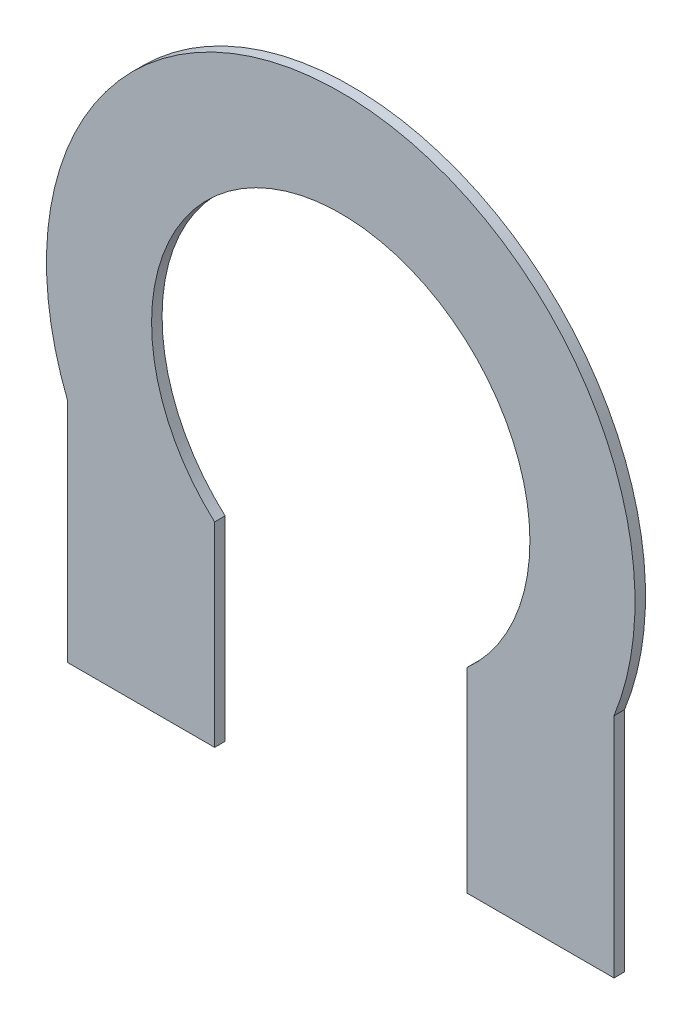
ISO-10303-21;
HEADER;
FILE_DESCRIPTION(('STEP AP214'),'2;1');
FILE_NAME('part.step','',(''),(''),'','','');
FILE_SCHEMA(('AUTOMOTIVE_DESIGN { 1 0 10303 214 1 1 1 1 }'));
ENDSEC;
DATA;
#1=APPLICATION_CONTEXT('core data for automotive mechanical design processes');
#2=APPLICATION_PROTOCOL_DEFINITION('international standard','automotive_design',2000,#1);
#3=PRODUCT_CONTEXT('',#1,'mechanical');
#4=PRODUCT('Part','Part','',(#3));
#5=PRODUCT_RELATED_PRODUCT_CATEGORY('part','',(#4));
#6=PRODUCT_DEFINITION_FORMATION('','',#4);
#7=PRODUCT_DEFINITION_CONTEXT('part definition',#1,'design');
#8=PRODUCT_DEFINITION('design','',#6,#7);
#9=PRODUCT_DEFINITION_SHAPE('','',#8);
#10=(LENGTH_UNIT() NAMED_UNIT(*) SI_UNIT(.MILLI.,.METRE.));
#11=(NAMED_UNIT(*) PLANE_ANGLE_UNIT() SI_UNIT($,.RADIAN.));
#12=(NAMED_UNIT(*) SI_UNIT($,.STERADIAN.) SOLID_ANGLE_UNIT());
#13=UNCERTAINTY_MEASURE_WITH_UNIT(LENGTH_MEASURE(1.E-05),#10,'distance_accuracy_value','');
#14=(GEOMETRIC_REPRESENTATION_CONTEXT(3) GLOBAL_UNCERTAINTY_ASSIGNED_CONTEXT((#13)) GLOBAL_UNIT_ASSIGNED_CONTEXT((#10,
#11,#12)) REPRESENTATION_CONTEXT('',''));
#15=CARTESIAN_POINT('',(0.,0.,0.));
#16=DIRECTION('',(0.,0.,1.));
#17=DIRECTION('',(1.,0.,0.));
#18=AXIS2_PLACEMENT_3D('',#15,#16,#17);
#19=CARTESIAN_POINT('',(1.6963001622179,-2.601,-7.7));
#20=DIRECTION('',(0.,0.,-1.));
#21=DIRECTION('',(-1.,0.,0.));
#22=AXIS2_PLACEMENT_3D('',#19,#20,#21);
#23=PLANE('',#22);
#24=DIRECTION('',(1.,0.,0.));
#25=VECTOR('',#24,1.);
#26=CARTESIAN_POINT('',(0.95,-2.6,-7.7));
#27=LINE('',#26,#25);
#28=CARTESIAN_POINT('',(0.6,-2.6,-7.7));
#29=VERTEX_POINT('',#28);
#30=CARTESIAN_POINT('',(1.3,-2.6,-7.7));
#31=VERTEX_POINT('',#30);
#32=EDGE_CURVE('E141',#29,#31,#27,.T.);
#33=ORIENTED_EDGE('',*,*,#32,.F.);
#34=DIRECTION('',(0.,-1.,0.));
#35=VECTOR('',#34,1.);
#36=CARTESIAN_POINT('',(0.6,-2.135410196625,-7.7));
#37=LINE('',#36,#35);
#38=CARTESIAN_POINT('',(0.6,-1.6708203932498,-7.7));
#39=VERTEX_POINT('',#38);
#40=EDGE_CURVE('E92',#39,#29,#37,.T.);
#41=ORIENTED_EDGE('',*,*,#40,.F.);
#42=CARTESIAN_POINT('',(-1.84140224667253E-13,-1.00000000000004,-7.7));
#43=DIRECTION('',(0.,0.,-1.));
#44=DIRECTION('',(-1.,0.,0.));
#45=AXIS2_PLACEMENT_3D('',#42,#43,#44);
#46=CIRCLE('',#45,0.899999999999845);
#47=CARTESIAN_POINT('',(-0.6,-1.67082039324997,-7.7));
#48=VERTEX_POINT('',#47);
#49=EDGE_CURVE('E21',#48,#39,#46,.T.);
#50=ORIENTED_EDGE('',*,*,#49,.F.);
#51=DIRECTION('',(0.,-1.,0.));
#52=VECTOR('',#51,1.);
#53=CARTESIAN_POINT('',(-0.6,-0.920462059558933,-7.7));
#54=LINE('',#53,#52);
#55=CARTESIAN_POINT('',(-0.6,-2.6,-7.7));
#56=VERTEX_POINT('',#55);
#57=EDGE_CURVE('E80',#48,#56,#54,.T.);
#58=ORIENTED_EDGE('',*,*,#57,.T.);
#59=DIRECTION('',(-1.,0.,0.));
#60=VECTOR('',#59,1.);
#61=CARTESIAN_POINT('',(0.,-2.6,-7.7));
#62=LINE('',#61,#60);
#63=CARTESIAN_POINT('',(-1.3,-2.6,-7.7));
#64=VERTEX_POINT('',#63);
#65=EDGE_CURVE('E87',#56,#64,#62,.T.);
#66=ORIENTED_EDGE('',*,*,#65,.T.);
#67=DIRECTION('',(0.,1.,0.));
#68=VECTOR('',#67,1.);
#69=CARTESIAN_POINT('',(-1.3,-0.920462059558933,-7.7));
#70=LINE('',#69,#68);
#71=CARTESIAN_POINT('',(-1.3,-1.51961524227034,-7.7));
#72=VERTEX_POINT('',#71);
#73=EDGE_CURVE('E96',#64,#72,#70,.T.);
#74=ORIENTED_EDGE('',*,*,#73,.T.);
#75=CARTESIAN_POINT('',(6.29541991453708E-13,-1.00000000000018,-7.7));
#76=DIRECTION('',(0.,0.,1.));
#77=DIRECTION('',(1.,0.,0.));
#78=AXIS2_PLACEMENT_3D('',#75,#76,#77);
#79=CIRCLE('',#78,1.40000000000052);
#80=CARTESIAN_POINT('',(1.30000000000012,-1.51961524227196,-7.7));
#81=VERTEX_POINT('',#80);
#82=EDGE_CURVE('E121',#81,#72,#79,.T.);
#83=ORIENTED_EDGE('',*,*,#82,.F.);
#84=DIRECTION('',(0.,1.,0.));
#85=VECTOR('',#84,1.);
#86=CARTESIAN_POINT('',(1.3,-2.059807621135,-7.7));
#87=LINE('',#86,#85);
#88=EDGE_CURVE('E125',#31,#81,#87,.T.);
#89=ORIENTED_EDGE('',*,*,#88,.F.);
#90=EDGE_LOOP('',(#33,#41,#50,#58,#66,#74,#83,#89));
#91=FACE_BOUND('',#90,.T.);
#92=ADVANCED_FACE('F17',(#91),#23,.T.);
#93=CARTESIAN_POINT('',(-1.84260159213911E-13,-1.00000000000004,-7.65));
#94=DIRECTION('',(0.,0.,-1.));
#95=DIRECTION('',(-1.,0.,0.));
#96=AXIS2_PLACEMENT_3D('',#93,#94,#95);
#97=CYLINDRICAL_SURFACE('',#96,0.899999999999845);
#98=CARTESIAN_POINT('',(-1.84260159213911E-13,-1.00000000000004,-7.65));
#99=DIRECTION('',(0.,0.,-1.));
#100=DIRECTION('',(-1.,0.,0.));
#101=AXIS2_PLACEMENT_3D('',#98,#99,#100);
#102=CIRCLE('',#101,0.899999999999845);
#103=CARTESIAN_POINT('',(-0.6,-1.67082039324997,-7.65));
#104=VERTEX_POINT('',#103);
#105=CARTESIAN_POINT('',(0.6,-1.6708203932498,-7.65));
#106=VERTEX_POINT('',#105);
#107=EDGE_CURVE('E99',#104,#106,#102,.T.);
#108=ORIENTED_EDGE('',*,*,#107,.F.);
#109=DIRECTION('',(0.,0.,1.));
#110=VECTOR('',#109,1.);
#111=CARTESIAN_POINT('',(-0.6,-1.67082039325,-7.675));
#112=LINE('',#111,#110);
#113=EDGE_CURVE('E84',#48,#104,#112,.T.);
#114=ORIENTED_EDGE('',*,*,#113,.F.);
#115=ORIENTED_EDGE('',*,*,#49,.T.);
#116=DIRECTION('',(0.,0.,-1.));
#117=VECTOR('',#116,1.);
#118=CARTESIAN_POINT('',(0.6,-1.67082039325,-7.675));
#119=LINE('',#118,#117);
#120=EDGE_CURVE('E95',#106,#39,#119,.T.);
#121=ORIENTED_EDGE('',*,*,#120,.F.);
#122=EDGE_LOOP('',(#108,#114,#115,#121));
#123=FACE_BOUND('',#122,.T.);
#124=ADVANCED_FACE('F97',(#123),#97,.F.);
#125=CARTESIAN_POINT('',(0.6,-2.601,-7.649));
#126=DIRECTION('',(-1.,0.,0.));
#127=DIRECTION('',(0.,1.,0.));
#128=AXIS2_PLACEMENT_3D('',#125,#126,#127);
#129=PLANE('',#128);
#130=ORIENTED_EDGE('',*,*,#120,.T.);
#131=ORIENTED_EDGE('',*,*,#40,.T.);
#132=DIRECTION('',(0.,0.,-1.));
#133=VECTOR('',#132,1.);
#134=CARTESIAN_POINT('',(0.6,-2.6,-7.675));
#135=LINE('',#134,#133);
#136=CARTESIAN_POINT('',(0.6,-2.6,-7.65));
#137=VERTEX_POINT('',#136);
#138=EDGE_CURVE('E129',#137,#29,#135,.T.);
#139=ORIENTED_EDGE('',*,*,#138,.F.);
#140=DIRECTION('',(0.,-1.,0.));
#141=VECTOR('',#140,1.);
#142=CARTESIAN_POINT('',(0.6,-0.920462059558933,-7.65));
#143=LINE('',#142,#141);
#144=EDGE_CURVE('E136',#106,#137,#143,.T.);
#145=ORIENTED_EDGE('',*,*,#144,.F.);
#146=EDGE_LOOP('',(#130,#131,#139,#145));
#147=FACE_BOUND('',#146,.T.);
#148=ADVANCED_FACE('F189',(#147),#129,.T.);
#149=CARTESIAN_POINT('',(1.301,-2.6,-7.649));
#150=DIRECTION('',(0.,-1.,0.));
#151=DIRECTION('',(-1.,0.,0.));
#152=AXIS2_PLACEMENT_3D('',#149,#150,#151);
#153=PLANE('',#152);
#154=DIRECTION('',(1.,0.,0.));
#155=VECTOR('',#154,1.);
#156=CARTESIAN_POINT('',(0.,-2.6,-7.65));
#157=LINE('',#156,#155);
#158=CARTESIAN_POINT('',(1.3,-2.6,-7.65));
#159=VERTEX_POINT('',#158);
#160=EDGE_CURVE('E132',#137,#159,#157,.T.);
#161=ORIENTED_EDGE('',*,*,#160,.F.);
#162=ORIENTED_EDGE('',*,*,#138,.T.);
#163=ORIENTED_EDGE('',*,*,#32,.T.);
#164=DIRECTION('',(0.,0.,-1.));
#165=VECTOR('',#164,1.);
#166=CARTESIAN_POINT('',(1.3,-2.6,-7.675));
#167=LINE('',#166,#165);
#168=EDGE_CURVE('E126',#159,#31,#167,.T.);
#169=ORIENTED_EDGE('',*,*,#168,.F.);
#170=EDGE_LOOP('',(#161,#162,#163,#169));
#171=FACE_BOUND('',#170,.T.);
#172=ADVANCED_FACE('F191',(#171),#153,.T.);
#173=CARTESIAN_POINT('',(1.3,-1.51861524227,-7.649));
#174=DIRECTION('',(1.,0.,0.));
#175=DIRECTION('',(0.,-1.,0.));
#176=AXIS2_PLACEMENT_3D('',#173,#174,#175);
#177=PLANE('',#176);
#178=ORIENTED_EDGE('',*,*,#168,.T.);
#179=ORIENTED_EDGE('',*,*,#88,.T.);
#180=DIRECTION('',(0.,0.,-1.));
#181=VECTOR('',#180,1.);
#182=CARTESIAN_POINT('',(1.30000000000023,-1.51961524227009,-7.675));
#183=LINE('',#182,#181);
#184=CARTESIAN_POINT('',(1.30000000000012,-1.51961524227196,-7.65));
#185=VERTEX_POINT('',#184);
#186=EDGE_CURVE('E122',#185,#81,#183,.T.);
#187=ORIENTED_EDGE('',*,*,#186,.F.);
#188=DIRECTION('',(0.,1.,0.));
#189=VECTOR('',#188,1.);
#190=CARTESIAN_POINT('',(1.3,-0.920462059558933,-7.65));
#191=LINE('',#190,#189);
#192=EDGE_CURVE('E135',#159,#185,#191,.T.);
#193=ORIENTED_EDGE('',*,*,#192,.F.);
#194=EDGE_LOOP('',(#178,#179,#187,#193));
#195=FACE_BOUND('',#194,.T.);
#196=ADVANCED_FACE('F192',(#195),#177,.T.);
#197=CARTESIAN_POINT('',(6.29541991453708E-13,-1.00000000000018,-7.7));
#198=DIRECTION('',(0.,0.,1.));
#199=DIRECTION('',(1.,0.,0.));
#200=AXIS2_PLACEMENT_3D('',#197,#198,#199);
#201=CYLINDRICAL_SURFACE('',#200,1.40000000000052);
#202=ORIENTED_EDGE('',*,*,#186,.T.);
#203=ORIENTED_EDGE('',*,*,#82,.T.);
#204=DIRECTION('',(0.,0.,-1.));
#205=VECTOR('',#204,1.);
#206=CARTESIAN_POINT('',(-1.3,-1.51961524227,-7.675));
#207=LINE('',#206,#205);
#208=CARTESIAN_POINT('',(-1.3,-1.51961524227034,-7.65));
#209=VERTEX_POINT('',#208);
#210=EDGE_CURVE('E104',#209,#72,#207,.T.);
#211=ORIENTED_EDGE('',*,*,#210,.F.);
#212=CARTESIAN_POINT('',(6.29477177192395E-13,-1.00000000000018,-7.65));
#213=DIRECTION('',(0.,0.,1.));
#214=DIRECTION('',(1.,0.,0.));
#215=AXIS2_PLACEMENT_3D('',#212,#213,#214);
#216=CIRCLE('',#215,1.40000000000052);
#217=EDGE_CURVE('E162',#185,#209,#216,.T.);
#218=ORIENTED_EDGE('',*,*,#217,.F.);
#219=EDGE_LOOP('',(#202,#203,#211,#218));
#220=FACE_BOUND('',#219,.T.);
#221=ADVANCED_FACE('F168',(#220),#201,.T.);
#222=CARTESIAN_POINT('',(-1.3,-2.601,-7.649));
#223=DIRECTION('',(-1.,0.,0.));
#224=DIRECTION('',(0.,1.,0.));
#225=AXIS2_PLACEMENT_3D('',#222,#223,#224);
#226=PLANE('',#225);
#227=DIRECTION('',(0.,-1.,0.));
#228=VECTOR('',#227,1.);
#229=CARTESIAN_POINT('',(-1.3,-0.920462059558933,-7.65));
#230=LINE('',#229,#228);
#231=CARTESIAN_POINT('',(-1.3,-2.6,-7.65));
#232=VERTEX_POINT('',#231);
#233=EDGE_CURVE('E114',#209,#232,#230,.T.);
#234=ORIENTED_EDGE('',*,*,#233,.F.);
#235=ORIENTED_EDGE('',*,*,#210,.T.);
#236=ORIENTED_EDGE('',*,*,#73,.F.);
#237=DIRECTION('',(0.,0.,-1.));
#238=VECTOR('',#237,1.);
#239=CARTESIAN_POINT('',(-1.3,-2.6,-7.675));
#240=LINE('',#239,#238);
#241=EDGE_CURVE('E100',#232,#64,#240,.T.);
#242=ORIENTED_EDGE('',*,*,#241,.F.);
#243=EDGE_LOOP('',(#234,#235,#236,#242));
#244=FACE_BOUND('',#243,.T.);
#245=ADVANCED_FACE('F173',(#244),#226,.T.);
#246=CARTESIAN_POINT('',(-0.599,-2.6,-7.649));
#247=DIRECTION('',(0.,-1.,0.));
#248=DIRECTION('',(-1.,0.,0.));
#249=AXIS2_PLACEMENT_3D('',#246,#247,#248);
#250=PLANE('',#249);
#251=DIRECTION('',(1.,0.,0.));
#252=VECTOR('',#251,1.);
#253=CARTESIAN_POINT('',(0.,-2.6,-7.65));
#254=LINE('',#253,#252);
#255=CARTESIAN_POINT('',(-0.6,-2.6,-7.65));
#256=VERTEX_POINT('',#255);
#257=EDGE_CURVE('E27',#232,#256,#254,.T.);
#258=ORIENTED_EDGE('',*,*,#257,.F.);
#259=ORIENTED_EDGE('',*,*,#241,.T.);
#260=ORIENTED_EDGE('',*,*,#65,.F.);
#261=DIRECTION('',(0.,0.,-1.));
#262=VECTOR('',#261,1.);
#263=CARTESIAN_POINT('',(-0.6,-2.6,-7.675));
#264=LINE('',#263,#262);
#265=EDGE_CURVE('E36',#256,#56,#264,.T.);
#266=ORIENTED_EDGE('',*,*,#265,.F.);
#267=EDGE_LOOP('',(#258,#259,#260,#266));
#268=FACE_BOUND('',#267,.T.);
#269=ADVANCED_FACE('F206',(#268),#250,.T.);
#270=CARTESIAN_POINT('',(-0.6,-1.66982039325,-7.649));
#271=DIRECTION('',(1.,0.,0.));
#272=DIRECTION('',(0.,-1.,0.));
#273=AXIS2_PLACEMENT_3D('',#270,#271,#272);
#274=PLANE('',#273);
#275=DIRECTION('',(0.,1.,0.));
#276=VECTOR('',#275,1.);
#277=CARTESIAN_POINT('',(-0.6,-0.920462059558933,-7.65));
#278=LINE('',#277,#276);
#279=EDGE_CURVE('E11',#256,#104,#278,.T.);
#280=ORIENTED_EDGE('',*,*,#279,.F.);
#281=ORIENTED_EDGE('',*,*,#265,.T.);
#282=ORIENTED_EDGE('',*,*,#57,.F.);
#283=ORIENTED_EDGE('',*,*,#113,.T.);
#284=EDGE_LOOP('',(#280,#281,#282,#283));
#285=FACE_BOUND('',#284,.T.);
#286=ADVANCED_FACE('F82',(#285),#274,.T.);
#287=CARTESIAN_POINT('',(1.6963001622179,0.760075880882134,-7.65));
#288=DIRECTION('',(0.,0.,1.));
#289=DIRECTION('',(-1.,0.,0.));
#290=AXIS2_PLACEMENT_3D('',#287,#288,#289);
#291=PLANE('',#290);
#292=ORIENTED_EDGE('',*,*,#257,.T.);
#293=ORIENTED_EDGE('',*,*,#279,.T.);
#294=ORIENTED_EDGE('',*,*,#107,.T.);
#295=ORIENTED_EDGE('',*,*,#144,.T.);
#296=ORIENTED_EDGE('',*,*,#160,.T.);
#297=ORIENTED_EDGE('',*,*,#192,.T.);
#298=ORIENTED_EDGE('',*,*,#217,.T.);
#299=ORIENTED_EDGE('',*,*,#233,.T.);
#300=EDGE_LOOP('',(#292,#293,#294,#295,#296,#297,#298,#299));
#301=FACE_BOUND('',#300,.T.);
#302=ADVANCED_FACE('F19',(#301),#291,.T.);
#303=CLOSED_SHELL('',(#92,#124,#148,#172,#196,#221,#245,#269,#286,#302));
#304=MANIFOLD_SOLID_BREP('B1',#303);
#305=ADVANCED_BREP_SHAPE_REPRESENTATION('',(#18,#304),#14);
#306=SHAPE_DEFINITION_REPRESENTATION(#9,#305);
ENDSEC;
END-ISO-10303-21;
